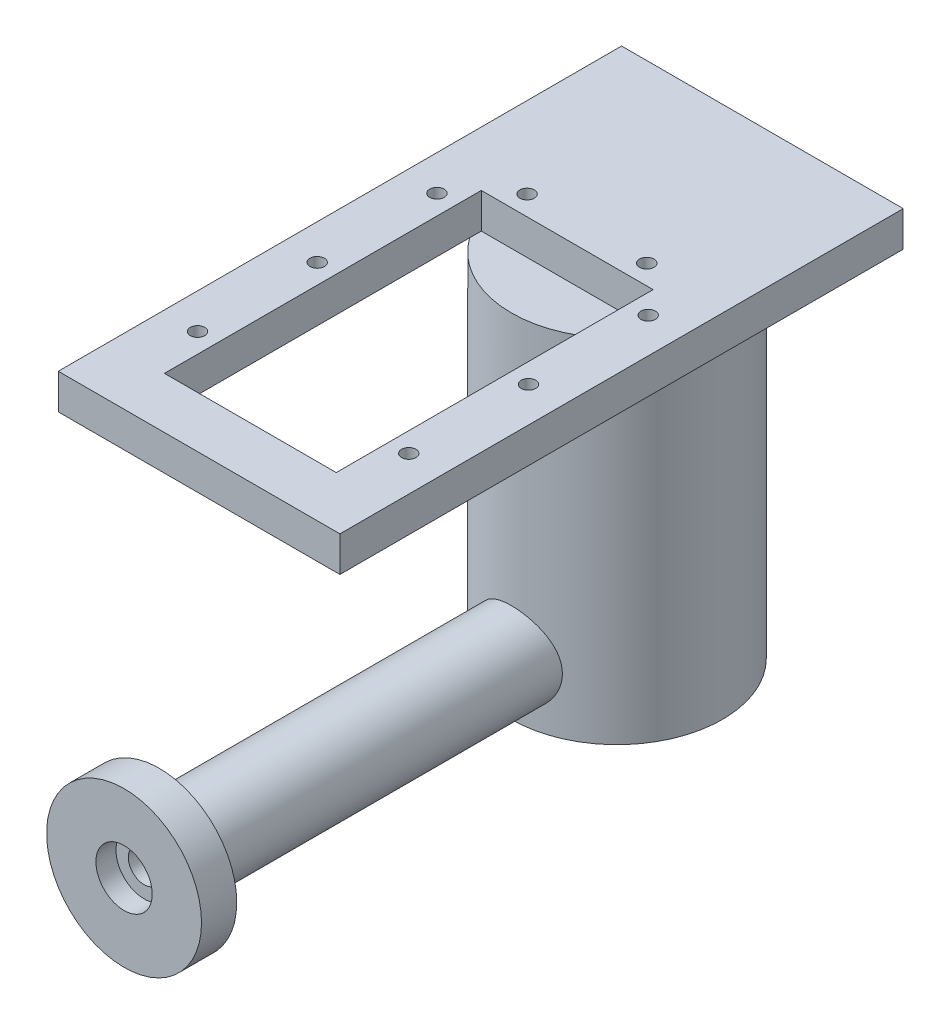
ISO-10303-21;
HEADER;
FILE_DESCRIPTION(('STEP AP214'),'2;1');
FILE_NAME('part.step','',(''),(''),'','','');
FILE_SCHEMA(('AUTOMOTIVE_DESIGN { 1 0 10303 214 1 1 1 1 }'));
ENDSEC;
DATA;
#1=APPLICATION_CONTEXT('core data for automotive mechanical design processes');
#2=APPLICATION_PROTOCOL_DEFINITION('international standard','automotive_design',2000,#1);
#3=PRODUCT_CONTEXT('',#1,'mechanical');
#4=PRODUCT('Part','Part','',(#3));
#5=PRODUCT_RELATED_PRODUCT_CATEGORY('part','',(#4));
#6=PRODUCT_DEFINITION_FORMATION('','',#4);
#7=PRODUCT_DEFINITION_CONTEXT('part definition',#1,'design');
#8=PRODUCT_DEFINITION('design','',#6,#7);
#9=PRODUCT_DEFINITION_SHAPE('','',#8);
#10=(LENGTH_UNIT() NAMED_UNIT(*) SI_UNIT(.MILLI.,.METRE.));
#11=(NAMED_UNIT(*) PLANE_ANGLE_UNIT() SI_UNIT($,.RADIAN.));
#12=(NAMED_UNIT(*) SI_UNIT($,.STERADIAN.) SOLID_ANGLE_UNIT());
#13=UNCERTAINTY_MEASURE_WITH_UNIT(LENGTH_MEASURE(1.E-05),#10,'distance_accuracy_value','');
#14=(GEOMETRIC_REPRESENTATION_CONTEXT(3) GLOBAL_UNCERTAINTY_ASSIGNED_CONTEXT((#13)) GLOBAL_UNIT_ASSIGNED_CONTEXT((#10,
#11,#12)) REPRESENTATION_CONTEXT('',''));
#15=CARTESIAN_POINT('',(0.,0.,0.));
#16=DIRECTION('',(0.,0.,1.));
#17=DIRECTION('',(1.,0.,0.));
#18=AXIS2_PLACEMENT_3D('',#15,#16,#17);
#19=CARTESIAN_POINT('',(0.,8.,65.));
#20=DIRECTION('',(0.,0.,-1.));
#21=DIRECTION('',(-1.,0.,0.));
#22=AXIS2_PLACEMENT_3D('',#19,#20,#21);
#23=CYLINDRICAL_SURFACE('',#22,6.);
#24=CARTESIAN_POINT('',(0.,8.,65.));
#25=DIRECTION('',(0.,0.,1.));
#26=DIRECTION('',(1.,0.,0.));
#27=AXIS2_PLACEMENT_3D('',#24,#25,#26);
#28=CIRCLE('',#27,6.);
#29=CARTESIAN_POINT('',(6.,8.,65.));
#30=VERTEX_POINT('',#29);
#31=EDGE_CURVE('E11',#30,#30,#28,.T.);
#32=ORIENTED_EDGE('',*,*,#31,.F.);
#33=EDGE_LOOP('',(#32));
#34=FACE_BOUND('',#33,.T.);
#35=CARTESIAN_POINT('',(6.,8.,13.7477270848675));
#36=CARTESIAN_POINT('',(5.99999875640954,8.16076598482738,13.7477283260629));
#37=CARTESIAN_POINT('',(5.99352975206176,8.32158110601548,13.7505565594333));
#38=CARTESIAN_POINT('',(5.96771672897827,8.64204882535129,13.7617785399654));
#39=CARTESIAN_POINT('',(5.94836482999676,8.80170065146873,13.7701756935283));
#40=CARTESIAN_POINT('',(5.89694174030869,9.11890142617686,13.7922754357519));
#41=CARTESIAN_POINT('',(5.86484520413903,9.27644553381237,13.8059885951419));
#42=CARTESIAN_POINT('',(5.78825391878448,9.58804060527395,13.8382744776157));
#43=CARTESIAN_POINT('',(5.74375401859824,9.74209008901072,13.8568492194736));
#44=CARTESIAN_POINT('',(5.64299599700453,10.0449832651282,13.8981849934125));
#45=CARTESIAN_POINT('',(5.58678827846126,10.1938461795796,13.9209280318917));
#46=CARTESIAN_POINT('',(5.46298123967255,10.4861745059142,13.969977180975));
#47=CARTESIAN_POINT('',(5.39537758446074,10.6296378383192,13.9962846467221));
#48=CARTESIAN_POINT('',(5.17633416323045,11.0504811630918,14.0794173286744));
#49=CARTESIAN_POINT('',(5.00853494267613,11.3186931077142,14.1405074748907));
#50=CARTESIAN_POINT('',(4.62391158998239,11.8378592545825,14.2710405221571));
#51=CARTESIAN_POINT('',(4.40499626343136,12.0871970513873,14.340752300891));
#52=CARTESIAN_POINT('',(4.0481020989243,12.4317390645763,14.4439708651047));
#53=CARTESIAN_POINT('',(3.9242905158216,12.5417399755175,14.4781748598032));
#54=CARTESIAN_POINT('',(3.66779743847793,12.7512789373329,14.5452673983772));
#55=CARTESIAN_POINT('',(3.53511902618019,12.850820593021,14.5781563930343));
#56=CARTESIAN_POINT('',(3.25615691069843,13.042541605752,14.6430448615306));
#57=CARTESIAN_POINT('',(3.10954147620186,13.1342681993675,14.6749563607157));
#58=CARTESIAN_POINT('',(2.80847871906791,13.3049385222444,14.7355355933009));
#59=CARTESIAN_POINT('',(2.65403441109174,13.3838871235516,14.7642045617649));
#60=CARTESIAN_POINT('',(2.33831705380736,13.5283274480482,14.8174861755334));
#61=CARTESIAN_POINT('',(2.1770447537532,13.5938206431435,14.8420992644581));
#62=CARTESIAN_POINT('',(1.8488303602226,13.710706307039,14.8865456688032));
#63=CARTESIAN_POINT('',(1.68188862975968,13.762099676745,14.9063792895972));
#64=CARTESIAN_POINT('',(1.35182764993867,13.8480957076311,14.9398371015626));
#65=CARTESIAN_POINT('',(1.18891435676812,13.8833905448022,14.9537153305611));
#66=CARTESIAN_POINT('',(0.860364736698413,13.940333707631,14.9762104160573));
#67=CARTESIAN_POINT('',(0.694728571347245,13.9619828399113,14.9848275835451));
#68=CARTESIAN_POINT('',(0.362083680846929,13.9913910715253,14.9965524359366));
#69=CARTESIAN_POINT('',(0.195075387211748,13.9991543815219,14.9996617909972));
#70=CARTESIAN_POINT('',(-0.139014166426377,14.0007146652515,15.0002858279534));
#71=CARTESIAN_POINT('',(-0.30609542365763,13.9945121299872,14.9978007065363));
#72=CARTESIAN_POINT('',(-0.629581360842823,13.9689571486784,14.9876056811723));
#73=CARTESIAN_POINT('',(-0.786056489987584,13.950366478925,14.9801985155737));
#74=CARTESIAN_POINT('',(-1.09682374164985,13.9009947102182,14.9606558816458));
#75=CARTESIAN_POINT('',(-1.25111513504043,13.8702096346988,14.9485188709466));
#76=CARTESIAN_POINT('',(-1.55636446880933,13.7967547638698,14.9198265516691));
#77=CARTESIAN_POINT('',(-1.70732347781249,13.7540888400518,14.9032726824411));
#78=CARTESIAN_POINT('',(-2.00504692560526,13.6572347463826,14.8661462906548));
#79=CARTESIAN_POINT('',(-2.15180974700395,13.6030421998243,14.8455722418593));
#80=CARTESIAN_POINT('',(-2.44232275401438,13.4827122452092,14.8005733913406));
#81=CARTESIAN_POINT('',(-2.58599723661979,13.4164113777625,14.7760965609745));
#82=CARTESIAN_POINT('',(-2.86725918170996,13.2729288476492,14.7241067343258));
#83=CARTESIAN_POINT('',(-3.00484439132129,13.1957432013856,14.696592627269));
#84=CARTESIAN_POINT('',(-3.40726603321778,12.948688374456,14.6104618941818));
#85=CARTESIAN_POINT('',(-3.66195901653258,12.7632418772394,14.5482260457696));
#86=CARTESIAN_POINT('',(-4.15437949370372,12.3419915764659,14.4156330049764));
#87=CARTESIAN_POINT('',(-4.38989525780835,12.1036809528053,14.3450108782861));
#88=CARTESIAN_POINT('',(-4.71121812404964,11.7191971043517,14.2413889925105));
#89=CARTESIAN_POINT('',(-4.81305918105095,11.5864329939912,14.2072110490304));
#90=CARTESIAN_POINT('',(-5.0054684951315,11.3125897118592,14.1405668936191));
#91=CARTESIAN_POINT('',(-5.09604089492643,11.171513624108,14.1081000551767));
#92=CARTESIAN_POINT('',(-5.2677144885335,10.8776679791937,14.0449207716186));
#93=CARTESIAN_POINT('',(-5.34846830074845,10.7246787891823,14.0142856556237));
#94=CARTESIAN_POINT('',(-5.49666677344656,10.4117640686962,13.9568252487564));
#95=CARTESIAN_POINT('',(-5.56411683616808,10.2518413860096,13.9299984127055));
#96=CARTESIAN_POINT('',(-5.68507549818268,9.92615715736025,13.8810726170423));
#97=CARTESIAN_POINT('',(-5.73858849912392,9.76039747367877,13.8589721651234));
#98=CARTESIAN_POINT('',(-5.83111405710325,9.42425050711976,13.8202977451039));
#99=CARTESIAN_POINT('',(-5.87012778144672,9.2538635979558,13.803723332125));
#100=CARTESIAN_POINT('',(-5.93126188446898,8.92037550293277,13.7775602957139));
#101=CARTESIAN_POINT('',(-5.95426866502425,8.75746509869363,13.7676067715781));
#102=CARTESIAN_POINT('',(-5.98682783069773,8.4300594191083,13.7534799529363));
#103=CARTESIAN_POINT('',(-5.99638101339171,8.26556423829532,13.7493063157788));
#104=CARTESIAN_POINT('',(-6.00192022727181,7.93634499724553,13.7468891908443));
#105=CARTESIAN_POINT('',(-5.99790972463034,7.77162100623468,13.7486441880165));
#106=CARTESIAN_POINT('',(-5.97637695694085,7.44323030234847,13.7580178863429));
#107=CARTESIAN_POINT('',(-5.95885503253298,7.27956356292335,13.7656364396694));
#108=CARTESIAN_POINT('',(-5.91189113707813,6.96388493285905,13.7858678469555));
#109=CARTESIAN_POINT('',(-5.88318889041452,6.81174216524755,13.7981698606254));
#110=CARTESIAN_POINT('',(-5.81422990546568,6.51049878730527,13.8273689308218));
#111=CARTESIAN_POINT('',(-5.77396942701893,6.36139917847391,13.8442674746596));
#112=CARTESIAN_POINT('',(-5.68227161206331,6.0672507608385,13.8821556875076));
#113=CARTESIAN_POINT('',(-5.63083646021821,5.92220116649752,13.9031445567712));
#114=CARTESIAN_POINT('',(-5.51718647350251,5.63689974950036,13.9486342853423));
#115=CARTESIAN_POINT('',(-5.45496750289055,5.49664979237216,13.9731364914375));
#116=CARTESIAN_POINT('',(-5.31751145640008,5.21622103433919,14.0260368054118));
#117=CARTESIAN_POINT('',(-5.24185178482307,5.07627148339986,14.054551887834));
#118=CARTESIAN_POINT('',(-5.07988717682862,4.80313174732677,14.1139004091642));
#119=CARTESIAN_POINT('',(-4.99357859530799,4.66994389885387,14.144734640495));
#120=CARTESIAN_POINT('',(-4.81086355761932,4.41103058661941,14.2079180408565));
#121=CARTESIAN_POINT('',(-4.71445526541627,4.28530648622995,14.2402674847459));
#122=CARTESIAN_POINT('',(-4.51210358125893,4.04197483985672,14.3056711379351));
#123=CARTESIAN_POINT('',(-4.40615981558121,3.92436761231666,14.338725374819));
#124=CARTESIAN_POINT('',(-4.17710486838273,3.68947089789745,14.4071898083664));
#125=CARTESIAN_POINT('',(-4.05330323673504,3.57285146369598,14.442592979753));
#126=CARTESIAN_POINT('',(-3.79611595891185,3.35044107746035,14.5123136561683));
#127=CARTESIAN_POINT('',(-3.66273336488668,3.24464670276108,14.5466315019691));
#128=CARTESIAN_POINT('',(-3.38706145939603,3.04451435610423,14.6132792135403));
#129=CARTESIAN_POINT('',(-3.24476806677012,2.95018169264924,14.6456081547515));
#130=CARTESIAN_POINT('',(-2.95225256674959,2.77378136334621,14.7073633349577));
#131=CARTESIAN_POINT('',(-2.80203390506011,2.69170842578634,14.7367908197248));
#132=CARTESIAN_POINT('',(-2.49453307495679,2.54045157600446,14.7919473555791));
#133=CARTESIAN_POINT('',(-2.3372490996887,2.47127098437562,14.8176754534518));
#134=CARTESIAN_POINT('',(-2.01680521759424,2.34650155372973,14.8646797598965));
#135=CARTESIAN_POINT('',(-1.85364780662784,2.29090701787589,14.8859578338886));
#136=CARTESIAN_POINT('',(-1.52264805192433,2.19385845199868,14.9234471639802));
#137=CARTESIAN_POINT('',(-1.35480680859647,2.15240113036746,14.9396595994531));
#138=CARTESIAN_POINT('',(-1.01574606559106,2.08407562736268,14.9665350610502));
#139=CARTESIAN_POINT('',(-0.844526795116487,2.05720645967028,14.9771984623478));
#140=CARTESIAN_POINT('',(-0.511396994408887,2.01963967541453,14.9921458117432));
#141=CARTESIAN_POINT('',(-0.349608608417646,2.00800071584866,14.9968008342727));
#142=CARTESIAN_POINT('',(-0.0255568035504901,1.99786526314398,15.0008532559057));
#143=CARTESIAN_POINT('',(0.13670659774313,1.99936828956347,15.0002508472092));
#144=CARTESIAN_POINT('',(0.460449157871509,2.01549904517884,14.9938053140504));
#145=CARTESIAN_POINT('',(0.621928426150297,2.03012488656084,14.9879629433954));
#146=CARTESIAN_POINT('',(0.942913616351041,2.07234304237388,14.9711970812456));
#147=CARTESIAN_POINT('',(1.10241954563224,2.09993530843377,14.9602736087057));
#148=CARTESIAN_POINT('',(1.41340092731344,2.16675006249559,14.9340514560138));
#149=CARTESIAN_POINT('',(1.56497209153591,2.20558587323356,14.9188987624389));
#150=CARTESIAN_POINT('',(1.86423948532529,2.29482683138478,14.8844652752771));
#151=CARTESIAN_POINT('',(2.01193442094207,2.34523578871987,14.8651831223981));
#152=CARTESIAN_POINT('',(2.302462712288,2.45717619515102,14.8229622791787));
#153=CARTESIAN_POINT('',(2.44529715629449,2.51870513472082,14.8000244139869));
#154=CARTESIAN_POINT('',(2.72537941223682,2.65243971671062,14.7510179336099));
#155=CARTESIAN_POINT('',(2.86262507421093,2.72464941936831,14.7249481285447));
#156=CARTESIAN_POINT('',(3.13662388518831,2.88260994638361,14.6690826919464));
#157=CARTESIAN_POINT('',(3.27309180108705,2.96881555131694,14.6391738407242));
#158=CARTESIAN_POINT('',(3.53838180351729,3.15171951689201,14.5773253906917));
#159=CARTESIAN_POINT('',(3.66720122604104,3.24842150069047,14.5453850922484));
#160=CARTESIAN_POINT('',(3.91649343612947,3.4517088619109,14.480251425724));
#161=CARTESIAN_POINT('',(4.03696455988819,3.55829619963079,14.447057809883));
#162=CARTESIAN_POINT('',(4.26890539529756,3.78072670262355,14.3802300314779));
#163=CARTESIAN_POINT('',(4.38037483126384,3.89657015115672,14.3465958554578));
#164=CARTESIAN_POINT('',(4.6003520349242,4.14436931770692,14.2776350231095));
#165=CARTESIAN_POINT('',(4.70824454883581,4.27687901691599,14.2423331872708));
#166=CARTESIAN_POINT('',(4.91246454048886,4.55081614977952,14.1731899755842));
#167=CARTESIAN_POINT('',(5.0087959135827,4.69224055512317,14.1393481102969));
#168=CARTESIAN_POINT('',(5.18930521843518,4.98330426589871,14.0741014017048));
#169=CARTESIAN_POINT('',(5.27347593316246,5.13294837739946,14.0426980106418));
#170=CARTESIAN_POINT('',(5.42888140715686,5.43938662075409,13.9833532160291));
#171=CARTESIAN_POINT('',(5.50012246229139,5.59617722596415,13.9554101296628));
#172=CARTESIAN_POINT('',(5.62329338728312,5.90161698772481,13.9062060888812));
#173=CARTESIAN_POINT('',(5.67638059374281,6.0497399517391,13.8845710059473));
#174=CARTESIAN_POINT('',(5.77085722264898,6.3501563851321,13.8455704717994));
#175=CARTESIAN_POINT('',(5.81225194839873,6.5024479292954,13.8282030853728));
#176=CARTESIAN_POINT('',(5.88290316620707,6.80992357107783,13.7982941020336));
#177=CARTESIAN_POINT('',(5.91218652902551,6.9651004584769,13.7857418266595));
#178=CARTESIAN_POINT('',(5.95843701087142,7.27754448449443,13.7658152395796));
#179=CARTESIAN_POINT('',(5.97541127868373,7.43481035575322,13.7584379224814));
#180=CARTESIAN_POINT('',(5.99076318011059,7.66032523302881,13.751755327731));
#181=CARTESIAN_POINT('',(5.99422579943118,7.72819955445766,13.7502459479373));
#182=CARTESIAN_POINT('',(5.99884455686221,7.86404631736154,13.7482315272618));
#183=CARTESIAN_POINT('',(6.00000052586257,7.9320187656651,13.7477265600177));
#184=CARTESIAN_POINT('',(6.,8.,13.7477270848675));
#185=B_SPLINE_CURVE_WITH_KNOTS('',3,(#35,#36,#37,#38,#39,#40,#41,#42,#43,#44,#45,#46,#47,#48,
#49,#50,#51,#52,#53,#54,#55,#56,#57,#58,#59,#60,#61,#62,#63,#64,#65,#66,#67,#68,#69,#70,#71,#72,
#73,#74,#75,#76,#77,#78,#79,#80,#81,#82,#83,#84,#85,#86,#87,#88,#89,#90,#91,#92,#93,#94,#95,#96,
#97,#98,#99,#100,#101,#102,#103,#104,#105,#106,#107,#108,#109,#110,#111,#112,#113,#114,#115,
#116,#117,#118,#119,#120,#121,#122,#123,#124,#125,#126,#127,#128,#129,#130,#131,#132,#133,#134,
#135,#136,#137,#138,#139,#140,#141,#142,#143,#144,#145,#146,#147,#148,#149,#150,#151,#152,#153,
#154,#155,#156,#157,#158,#159,#160,#161,#162,#163,#164,#165,#166,#167,#168,#169,#170,#171,#172,
#173,#174,#175,#176,#177,#178,#179,#180,#181,#182,#183,#184),.UNSPECIFIED.,.T.,.F.,(4,2,2,2,2,2,
2,2,2,2,2,2,2,2,2,2,2,2,2,2,2,2,2,2,2,2,2,2,2,2,2,2,2,2,2,2,2,2,2,2,2,2,2,2,2,2,2,2,2,2,2,2,2,2,
2,2,2,2,2,2,2,2,2,2,2,2,2,2,2,2,2,2,2,2,4),(0.,0.482229125007606,0.964753492666786,
1.44824230932755,1.93193221431692,2.41358131868909,2.89541405552194,3.85788445035762,
4.87027013417452,5.37714851669966,5.88385162504574,6.41078994114098,6.93752686828076,
7.4642061442031,7.99085176020979,8.4920122856123,8.99314318371741,9.49412209577398,
9.99508339499091,10.4677763229104,10.9406235219094,11.4133168189293,11.8861899210207,
12.3659950936627,12.8459763227003,13.8053197638543,14.827648638094,15.3395121452938,
15.8511869156833,16.3775800271824,16.9037589447638,17.429771480738,17.9557416594036,
18.4495809207953,18.9433909044569,19.4370747055101,19.9307460605728,20.3961592499499,
20.8617232138062,21.3271962410503,21.7928481801528,22.2772086524077,22.7617353827804,
23.2463503490362,23.7309843170643,24.2515501140932,24.7719508068031,25.2925916122044,
25.8130078923152,26.3335580277819,26.8538895128004,27.3740997647064,27.8942748403263,
28.3804860466243,28.8666794781986,29.3528029784681,29.8389246652723,30.309990273523,
30.7812111812125,31.2523258775871,31.7236201282936,32.2155707501999,32.7076917276986,
33.1999105039097,33.6921443490278,34.2149887213889,34.7376564316676,35.2606330684224,
35.7833543637692,36.2593204433439,36.7350702933027,37.2097588887462,37.684171576794,
37.8880712265046,38.0919858243933),.UNSPECIFIED.);
#186=CARTESIAN_POINT('',(6.,8.,13.7477270848675));
#187=VERTEX_POINT('',#186);
#188=EDGE_CURVE('E53',#187,#187,#185,.T.);
#189=ORIENTED_EDGE('',*,*,#188,.T.);
#190=EDGE_LOOP('',(#189));
#191=FACE_BOUND('',#190,.T.);
#192=ADVANCED_FACE('F47',(#34,#191),#23,.T.);
#193=CARTESIAN_POINT('',(0.,50.,0.));
#194=DIRECTION('',(0.,-1.,0.));
#195=DIRECTION('',(0.,0.,-1.));
#196=AXIS2_PLACEMENT_3D('',#193,#194,#195);
#197=CYLINDRICAL_SURFACE('',#196,15.);
#198=ORIENTED_EDGE('',*,*,#188,.F.);
#199=EDGE_LOOP('',(#198));
#200=FACE_BOUND('',#199,.T.);
#201=ADVANCED_FACE('F69',(#200),#197,.F.);
#202=CARTESIAN_POINT('',(0.,8.,70.));
#203=DIRECTION('',(0.,0.,-1.));
#204=DIRECTION('',(-1.,0.,0.));
#205=AXIS2_PLACEMENT_3D('',#202,#203,#204);
#206=CYLINDRICAL_SURFACE('',#205,11.);
#207=CARTESIAN_POINT('',(0.,8.,70.));
#208=DIRECTION('',(0.,0.,1.));
#209=DIRECTION('',(1.,0.,0.));
#210=AXIS2_PLACEMENT_3D('',#207,#208,#209);
#211=CIRCLE('',#210,11.);
#212=CARTESIAN_POINT('',(11.,8.,70.));
#213=VERTEX_POINT('',#212);
#214=EDGE_CURVE('E57',#213,#213,#211,.T.);
#215=ORIENTED_EDGE('',*,*,#214,.F.);
#216=EDGE_LOOP('',(#215));
#217=FACE_BOUND('',#216,.T.);
#218=CARTESIAN_POINT('',(0.,8.,65.));
#219=DIRECTION('',(0.,0.,1.));
#220=DIRECTION('',(1.,0.,0.));
#221=AXIS2_PLACEMENT_3D('',#218,#219,#220);
#222=CIRCLE('',#221,11.);
#223=CARTESIAN_POINT('',(11.,8.,65.));
#224=VERTEX_POINT('',#223);
#225=EDGE_CURVE('E61',#224,#224,#222,.T.);
#226=ORIENTED_EDGE('',*,*,#225,.T.);
#227=EDGE_LOOP('',(#226));
#228=FACE_BOUND('',#227,.T.);
#229=ADVANCED_FACE('F73',(#217,#228),#206,.T.);
#230=CARTESIAN_POINT('',(0.,8.,70.));
#231=DIRECTION('',(0.,0.,1.));
#232=DIRECTION('',(1.,0.,0.));
#233=AXIS2_PLACEMENT_3D('',#230,#231,#232);
#234=PLANE('',#233);
#235=CARTESIAN_POINT('',(0.,8.,70.));
#236=DIRECTION('',(0.,0.,1.));
#237=DIRECTION('',(1.,0.,0.));
#238=AXIS2_PLACEMENT_3D('',#235,#236,#237);
#239=CIRCLE('',#238,4.);
#240=CARTESIAN_POINT('',(4.,8.,70.));
#241=VERTEX_POINT('',#240);
#242=EDGE_CURVE('E162',#241,#241,#239,.T.);
#243=ORIENTED_EDGE('',*,*,#242,.F.);
#244=EDGE_LOOP('',(#243));
#245=FACE_BOUND('',#244,.T.);
#246=ORIENTED_EDGE('',*,*,#214,.T.);
#247=EDGE_LOOP('',(#246));
#248=FACE_BOUND('',#247,.T.);
#249=ADVANCED_FACE('F77',(#245,#248),#234,.T.);
#250=CARTESIAN_POINT('',(0.,8.,65.));
#251=DIRECTION('',(0.,0.,1.));
#252=DIRECTION('',(1.,0.,0.));
#253=AXIS2_PLACEMENT_3D('',#250,#251,#252);
#254=PLANE('',#253);
#255=ORIENTED_EDGE('',*,*,#31,.T.);
#256=EDGE_LOOP('',(#255));
#257=FACE_BOUND('',#256,.T.);
#258=ORIENTED_EDGE('',*,*,#225,.F.);
#259=EDGE_LOOP('',(#258));
#260=FACE_BOUND('',#259,.T.);
#261=ADVANCED_FACE('F79',(#257,#260),#254,.F.);
#262=CARTESIAN_POINT('',(0.,8.,67.15));
#263=DIRECTION('',(0.,0.,1.));
#264=DIRECTION('',(1.,0.,0.));
#265=AXIS2_PLACEMENT_3D('',#262,#263,#264);
#266=CYLINDRICAL_SURFACE('',#265,4.);
#267=CARTESIAN_POINT('',(0.,8.,67.15));
#268=DIRECTION('',(0.,0.,1.));
#269=DIRECTION('',(1.,0.,0.));
#270=AXIS2_PLACEMENT_3D('',#267,#268,#269);
#271=CIRCLE('',#270,4.);
#272=CARTESIAN_POINT('',(4.,8.,67.15));
#273=VERTEX_POINT('',#272);
#274=EDGE_CURVE('E166',#273,#273,#271,.T.);
#275=ORIENTED_EDGE('',*,*,#274,.F.);
#276=EDGE_LOOP('',(#275));
#277=FACE_BOUND('',#276,.T.);
#278=ORIENTED_EDGE('',*,*,#242,.T.);
#279=EDGE_LOOP('',(#278));
#280=FACE_BOUND('',#279,.T.);
#281=ADVANCED_FACE('F82',(#277,#280),#266,.F.);
#282=CARTESIAN_POINT('',(0.,8.,67.15));
#283=DIRECTION('',(0.,0.,1.));
#284=DIRECTION('',(1.,0.,0.));
#285=AXIS2_PLACEMENT_3D('',#282,#283,#284);
#286=PLANE('',#285);
#287=CARTESIAN_POINT('',(0.,8.,67.15));
#288=DIRECTION('',(0.,0.,1.));
#289=DIRECTION('',(1.,0.,0.));
#290=AXIS2_PLACEMENT_3D('',#287,#288,#289);
#291=CIRCLE('',#290,2.25);
#292=CARTESIAN_POINT('',(2.25,8.,67.15));
#293=VERTEX_POINT('',#292);
#294=EDGE_CURVE('E163',#293,#293,#291,.T.);
#295=ORIENTED_EDGE('',*,*,#294,.F.);
#296=EDGE_LOOP('',(#295));
#297=FACE_BOUND('',#296,.T.);
#298=ORIENTED_EDGE('',*,*,#274,.T.);
#299=EDGE_LOOP('',(#298));
#300=FACE_BOUND('',#299,.T.);
#301=ADVANCED_FACE('F88',(#297,#300),#286,.T.);
#302=CARTESIAN_POINT('',(0.,8.,64.65));
#303=DIRECTION('',(0.,0.,1.));
#304=DIRECTION('',(1.,0.,0.));
#305=AXIS2_PLACEMENT_3D('',#302,#303,#304);
#306=CYLINDRICAL_SURFACE('',#305,2.25);
#307=CARTESIAN_POINT('',(0.,8.,64.65));
#308=DIRECTION('',(0.,0.,1.));
#309=DIRECTION('',(1.,0.,0.));
#310=AXIS2_PLACEMENT_3D('',#307,#308,#309);
#311=CIRCLE('',#310,2.25);
#312=CARTESIAN_POINT('',(2.25,8.,64.65));
#313=VERTEX_POINT('',#312);
#314=EDGE_CURVE('E161',#313,#313,#311,.T.);
#315=ORIENTED_EDGE('',*,*,#314,.F.);
#316=EDGE_LOOP('',(#315));
#317=FACE_BOUND('',#316,.T.);
#318=ORIENTED_EDGE('',*,*,#294,.T.);
#319=EDGE_LOOP('',(#318));
#320=FACE_BOUND('',#319,.T.);
#321=ADVANCED_FACE('F92',(#317,#320),#306,.F.);
#322=CARTESIAN_POINT('',(0.,8.,64.65));
#323=DIRECTION('',(0.,0.,1.));
#324=DIRECTION('',(1.,0.,0.));
#325=AXIS2_PLACEMENT_3D('',#322,#323,#324);
#326=PLANE('',#325);
#327=ORIENTED_EDGE('',*,*,#314,.T.);
#328=EDGE_LOOP('',(#327));
#329=FACE_BOUND('',#328,.T.);
#330=ADVANCED_FACE('F96',(#329),#326,.T.);
#331=CLOSED_SHELL('',(#192,#201,#229,#249,#261,#281,#301,#321,#330));
#332=MANIFOLD_SOLID_BREP('B2',#331);
#333=CARTESIAN_POINT('',(0.,50.,0.));
#334=DIRECTION('',(0.,1.,0.));
#335=DIRECTION('',(0.,0.,1.));
#336=AXIS2_PLACEMENT_3D('',#333,#334,#335);
#337=PLANE('',#336);
#338=DIRECTION('',(-1.,0.,0.));
#339=VECTOR('',#338,1.);
#340=CARTESIAN_POINT('',(-12.2,50.,7.06804977885682));
#341=LINE('',#340,#339);
#342=CARTESIAN_POINT('',(12.2,50.,7.06804977885682));
#343=VERTEX_POINT('',#342);
#344=CARTESIAN_POINT('',(-12.2,50.,7.06804977885682));
#345=VERTEX_POINT('',#344);
#346=EDGE_CURVE('E204',#343,#345,#341,.T.);
#347=ORIENTED_EDGE('',*,*,#346,.T.);
#348=DIRECTION('',(0.,0.,1.));
#349=VECTOR('',#348,1.);
#350=CARTESIAN_POINT('',(-12.2,50.,52.0680497788568));
#351=LINE('',#350,#349);
#352=CARTESIAN_POINT('',(-12.2,50.,8.72696969170859));
#353=VERTEX_POINT('',#352);
#354=EDGE_CURVE('E291',#345,#353,#351,.T.);
#355=ORIENTED_EDGE('',*,*,#354,.T.);
#356=CARTESIAN_POINT('',(0.,50.,0.));
#357=DIRECTION('',(0.,1.,0.));
#358=DIRECTION('',(0.,0.,1.));
#359=AXIS2_PLACEMENT_3D('',#356,#357,#358);
#360=CIRCLE('',#359,15.);
#361=CARTESIAN_POINT('',(12.2,50.,8.72696969170859));
#362=VERTEX_POINT('',#361);
#363=EDGE_CURVE('E329',#353,#362,#360,.T.);
#364=ORIENTED_EDGE('',*,*,#363,.T.);
#365=DIRECTION('',(0.,0.,-1.));
#366=VECTOR('',#365,1.);
#367=CARTESIAN_POINT('',(12.2,50.,52.0680497788568));
#368=LINE('',#367,#366);
#369=EDGE_CURVE('E45',#362,#343,#368,.T.);
#370=ORIENTED_EDGE('',*,*,#369,.T.);
#371=EDGE_LOOP('',(#347,#355,#364,#370));
#372=FACE_BOUND('',#371,.T.);
#373=ADVANCED_FACE('F186',(#372),#337,.T.);
#374=CARTESIAN_POINT('',(0.,50.,0.));
#375=DIRECTION('',(0.,-1.,0.));
#376=DIRECTION('',(0.,0.,-1.));
#377=AXIS2_PLACEMENT_3D('',#374,#375,#376);
#378=CYLINDRICAL_SURFACE('',#377,15.);
#379=EDGE_CURVE('E195',#362,#353,#360,.T.);
#380=ORIENTED_EDGE('',*,*,#379,.F.);
#381=ORIENTED_EDGE('',*,*,#363,.F.);
#382=EDGE_LOOP('',(#380,#381));
#383=FACE_BOUND('',#382,.T.);
#384=CARTESIAN_POINT('',(0.,0.,0.));
#385=DIRECTION('',(0.,1.,0.));
#386=DIRECTION('',(0.,0.,1.));
#387=AXIS2_PLACEMENT_3D('',#384,#385,#386);
#388=CIRCLE('',#387,15.);
#389=CARTESIAN_POINT('',(0.,0.,15.));
#390=VERTEX_POINT('',#389);
#391=EDGE_CURVE('E190',#390,#390,#388,.T.);
#392=ORIENTED_EDGE('',*,*,#391,.T.);
#393=EDGE_LOOP('',(#392));
#394=FACE_BOUND('',#393,.T.);
#395=ADVANCED_FACE('F188',(#383,#394),#378,.T.);
#396=CARTESIAN_POINT('',(0.,0.,0.));
#397=DIRECTION('',(0.,1.,0.));
#398=DIRECTION('',(0.,0.,1.));
#399=AXIS2_PLACEMENT_3D('',#396,#397,#398);
#400=PLANE('',#399);
#401=ORIENTED_EDGE('',*,*,#391,.F.);
#402=EDGE_LOOP('',(#401));
#403=FACE_BOUND('',#402,.T.);
#404=ADVANCED_FACE('F339',(#403),#400,.F.);
#405=CARTESIAN_POINT('',(0.,55.,0.));
#406=DIRECTION('',(0.,-1.,0.));
#407=DIRECTION('',(0.,0.,-1.));
#408=AXIS2_PLACEMENT_3D('',#405,#406,#407);
#409=PLANE('',#408);
#410=CARTESIAN_POINT('',(-15.0000000001374,55.,44.5680497778319));
#411=DIRECTION('',(0.,1.,0.));
#412=DIRECTION('',(0.,0.,1.));
#413=AXIS2_PLACEMENT_3D('',#410,#411,#412);
#414=CIRCLE('',#413,1.0249999998364);
#415=CARTESIAN_POINT('',(-15.0000000001374,55.,45.5930497776683));
#416=VERTEX_POINT('',#415);
#417=EDGE_CURVE('E470',#416,#416,#414,.T.);
#418=ORIENTED_EDGE('',*,*,#417,.F.);
#419=EDGE_LOOP('',(#418));
#420=FACE_BOUND('',#419,.T.);
#421=CARTESIAN_POINT('',(-15.0000000001377,55.,27.5680497778319));
#422=DIRECTION('',(0.,1.,0.));
#423=DIRECTION('',(0.,0.,1.));
#424=AXIS2_PLACEMENT_3D('',#421,#422,#423);
#425=CIRCLE('',#424,1.02499999983636);
#426=CARTESIAN_POINT('',(-15.0000000001377,55.,28.5930497776682));
#427=VERTEX_POINT('',#426);
#428=EDGE_CURVE('E464',#427,#427,#425,.T.);
#429=ORIENTED_EDGE('',*,*,#428,.F.);
#430=EDGE_LOOP('',(#429));
#431=FACE_BOUND('',#430,.T.);
#432=CARTESIAN_POINT('',(-15.000000000138,55.,10.5680497778319));
#433=DIRECTION('',(0.,1.,0.));
#434=DIRECTION('',(0.,0.,1.));
#435=AXIS2_PLACEMENT_3D('',#432,#433,#434);
#436=CIRCLE('',#435,1.02499999983631);
#437=CARTESIAN_POINT('',(-15.000000000138,55.,11.5930497776682));
#438=VERTEX_POINT('',#437);
#439=EDGE_CURVE('E458',#438,#438,#436,.T.);
#440=ORIENTED_EDGE('',*,*,#439,.F.);
#441=EDGE_LOOP('',(#440));
#442=FACE_BOUND('',#441,.T.);
#443=CARTESIAN_POINT('',(-8.50000000013805,55.,4.26804977783178));
#444=DIRECTION('',(0.,1.,0.));
#445=DIRECTION('',(0.,0.,1.));
#446=AXIS2_PLACEMENT_3D('',#443,#444,#445);
#447=CIRCLE('',#446,1.0249999998363);
#448=CARTESIAN_POINT('',(-8.50000000013805,55.,5.29304977766808));
#449=VERTEX_POINT('',#448);
#450=EDGE_CURVE('E452',#449,#449,#447,.T.);
#451=ORIENTED_EDGE('',*,*,#450,.F.);
#452=EDGE_LOOP('',(#451));
#453=FACE_BOUND('',#452,.T.);
#454=CARTESIAN_POINT('',(8.49999999986195,55.,4.26804977783152));
#455=DIRECTION('',(0.,1.,0.));
#456=DIRECTION('',(0.,0.,1.));
#457=AXIS2_PLACEMENT_3D('',#454,#455,#456);
#458=CIRCLE('',#457,1.02499999983631);
#459=CARTESIAN_POINT('',(8.49999999986195,55.,5.29304977766783));
#460=VERTEX_POINT('',#459);
#461=EDGE_CURVE('E446',#460,#460,#458,.T.);
#462=ORIENTED_EDGE('',*,*,#461,.F.);
#463=EDGE_LOOP('',(#462));
#464=FACE_BOUND('',#463,.T.);
#465=CARTESIAN_POINT('',(14.999999999862,55.,10.5680497778314));
#466=DIRECTION('',(0.,1.,0.));
#467=DIRECTION('',(0.,0.,1.));
#468=AXIS2_PLACEMENT_3D('',#465,#466,#467);
#469=CIRCLE('',#468,1.02499999983633);
#470=CARTESIAN_POINT('',(14.999999999862,55.,11.5930497776677));
#471=VERTEX_POINT('',#470);
#472=EDGE_CURVE('E440',#471,#471,#469,.T.);
#473=ORIENTED_EDGE('',*,*,#472,.F.);
#474=EDGE_LOOP('',(#473));
#475=FACE_BOUND('',#474,.T.);
#476=CARTESIAN_POINT('',(14.9999999998623,55.,27.5680497778314));
#477=DIRECTION('',(0.,1.,0.));
#478=DIRECTION('',(0.,0.,1.));
#479=AXIS2_PLACEMENT_3D('',#476,#477,#478);
#480=CIRCLE('',#479,1.02499999983637);
#481=CARTESIAN_POINT('',(14.9999999998623,55.,28.5930497776678));
#482=VERTEX_POINT('',#481);
#483=EDGE_CURVE('E427',#482,#482,#480,.T.);
#484=ORIENTED_EDGE('',*,*,#483,.F.);
#485=EDGE_LOOP('',(#484));
#486=FACE_BOUND('',#485,.T.);
#487=CARTESIAN_POINT('',(14.9999999998626,55.,44.5680497778314));
#488=DIRECTION('',(0.,1.,0.));
#489=DIRECTION('',(0.,0.,1.));
#490=AXIS2_PLACEMENT_3D('',#487,#488,#489);
#491=CIRCLE('',#490,1.02499999983641);
#492=CARTESIAN_POINT('',(14.9999999998626,55.,45.5930497776678));
#493=VERTEX_POINT('',#492);
#494=EDGE_CURVE('E432',#493,#493,#491,.T.);
#495=ORIENTED_EDGE('',*,*,#494,.F.);
#496=EDGE_LOOP('',(#495));
#497=FACE_BOUND('',#496,.T.);
#498=DIRECTION('',(0.,0.,1.));
#499=VECTOR('',#498,1.);
#500=CARTESIAN_POINT('',(-20.,55.,59.3446719480383));
#501=LINE('',#500,#499);
#502=CARTESIAN_POINT('',(-20.,55.,-20.6553280519617));
#503=VERTEX_POINT('',#502);
#504=CARTESIAN_POINT('',(-20.,55.,59.3446719480383));
#505=VERTEX_POINT('',#504);
#506=EDGE_CURVE('E301',#503,#505,#501,.T.);
#507=ORIENTED_EDGE('',*,*,#506,.T.);
#508=DIRECTION('',(1.,0.,0.));
#509=VECTOR('',#508,1.);
#510=CARTESIAN_POINT('',(-20.,55.,59.3446719480383));
#511=LINE('',#510,#509);
#512=CARTESIAN_POINT('',(20.,55.,59.3446719480383));
#513=VERTEX_POINT('',#512);
#514=EDGE_CURVE('E304',#505,#513,#511,.T.);
#515=ORIENTED_EDGE('',*,*,#514,.T.);
#516=DIRECTION('',(0.,0.,-1.));
#517=VECTOR('',#516,1.);
#518=CARTESIAN_POINT('',(20.,55.,59.3446719480383));
#519=LINE('',#518,#517);
#520=CARTESIAN_POINT('',(20.,55.,-20.6553280519617));
#521=VERTEX_POINT('',#520);
#522=EDGE_CURVE('E307',#513,#521,#519,.T.);
#523=ORIENTED_EDGE('',*,*,#522,.T.);
#524=DIRECTION('',(-1.,0.,0.));
#525=VECTOR('',#524,1.);
#526=CARTESIAN_POINT('',(-20.,55.,-20.6553280519617));
#527=LINE('',#526,#525);
#528=EDGE_CURVE('E309',#521,#503,#527,.T.);
#529=ORIENTED_EDGE('',*,*,#528,.T.);
#530=EDGE_LOOP('',(#507,#515,#523,#529));
#531=FACE_BOUND('',#530,.T.);
#532=DIRECTION('',(0.,0.,1.));
#533=VECTOR('',#532,1.);
#534=CARTESIAN_POINT('',(-12.2,55.,52.0680497788568));
#535=LINE('',#534,#533);
#536=CARTESIAN_POINT('',(-12.2,55.,7.06804977885682));
#537=VERTEX_POINT('',#536);
#538=CARTESIAN_POINT('',(-12.2,55.,52.0680497788568));
#539=VERTEX_POINT('',#538);
#540=EDGE_CURVE('E261',#537,#539,#535,.T.);
#541=ORIENTED_EDGE('',*,*,#540,.F.);
#542=DIRECTION('',(-1.,0.,0.));
#543=VECTOR('',#542,1.);
#544=CARTESIAN_POINT('',(-12.2,55.,7.06804977885682));
#545=LINE('',#544,#543);
#546=CARTESIAN_POINT('',(12.2,55.,7.06804977885682));
#547=VERTEX_POINT('',#546);
#548=EDGE_CURVE('E286',#547,#537,#545,.T.);
#549=ORIENTED_EDGE('',*,*,#548,.F.);
#550=DIRECTION('',(0.,0.,-1.));
#551=VECTOR('',#550,1.);
#552=CARTESIAN_POINT('',(12.2,55.,52.0680497788568));
#553=LINE('',#552,#551);
#554=CARTESIAN_POINT('',(12.2,55.,52.0680497788568));
#555=VERTEX_POINT('',#554);
#556=EDGE_CURVE('E284',#555,#547,#553,.T.);
#557=ORIENTED_EDGE('',*,*,#556,.F.);
#558=DIRECTION('',(1.,0.,0.));
#559=VECTOR('',#558,1.);
#560=CARTESIAN_POINT('',(-12.2,55.,52.0680497788568));
#561=LINE('',#560,#559);
#562=EDGE_CURVE('E270',#539,#555,#561,.T.);
#563=ORIENTED_EDGE('',*,*,#562,.F.);
#564=EDGE_LOOP('',(#541,#549,#557,#563));
#565=FACE_BOUND('',#564,.T.);
#566=ADVANCED_FACE('F282',(#420,#431,#442,#453,#464,#475,#486,#497,#531,#565),#409,.F.);
#567=CARTESIAN_POINT('',(0.,50.,0.));
#568=DIRECTION('',(0.,-1.,0.));
#569=DIRECTION('',(0.,0.,-1.));
#570=AXIS2_PLACEMENT_3D('',#567,#568,#569);
#571=PLANE('',#570);
#572=CARTESIAN_POINT('',(-15.0000000001374,50.,44.5680497778319));
#573=DIRECTION('',(0.,-1.,0.));
#574=DIRECTION('',(0.,0.,-1.));
#575=AXIS2_PLACEMENT_3D('',#572,#573,#574);
#576=CIRCLE('',#575,1.0249999998364);
#577=CARTESIAN_POINT('',(-15.0000000001374,50.,43.5430497779955));
#578=VERTEX_POINT('',#577);
#579=EDGE_CURVE('E467',#578,#578,#576,.F.);
#580=ORIENTED_EDGE('',*,*,#579,.T.);
#581=EDGE_LOOP('',(#580));
#582=FACE_BOUND('',#581,.T.);
#583=CARTESIAN_POINT('',(-15.0000000001377,50.,27.5680497778319));
#584=DIRECTION('',(0.,-1.,0.));
#585=DIRECTION('',(0.,0.,-1.));
#586=AXIS2_PLACEMENT_3D('',#583,#584,#585);
#587=CIRCLE('',#586,1.02499999983636);
#588=CARTESIAN_POINT('',(-15.0000000001377,50.,26.5430497779955));
#589=VERTEX_POINT('',#588);
#590=EDGE_CURVE('E461',#589,#589,#587,.F.);
#591=ORIENTED_EDGE('',*,*,#590,.T.);
#592=EDGE_LOOP('',(#591));
#593=FACE_BOUND('',#592,.T.);
#594=CARTESIAN_POINT('',(-15.000000000138,50.,10.5680497778319));
#595=DIRECTION('',(0.,-1.,0.));
#596=DIRECTION('',(0.,0.,-1.));
#597=AXIS2_PLACEMENT_3D('',#594,#595,#596);
#598=CIRCLE('',#597,1.02499999983631);
#599=CARTESIAN_POINT('',(-15.000000000138,50.,9.54304977799557));
#600=VERTEX_POINT('',#599);
#601=EDGE_CURVE('E455',#600,#600,#598,.F.);
#602=ORIENTED_EDGE('',*,*,#601,.T.);
#603=EDGE_LOOP('',(#602));
#604=FACE_BOUND('',#603,.T.);
#605=CARTESIAN_POINT('',(14.999999999862,50.,10.5680497778314));
#606=DIRECTION('',(0.,-1.,0.));
#607=DIRECTION('',(0.,0.,-1.));
#608=AXIS2_PLACEMENT_3D('',#605,#606,#607);
#609=CIRCLE('',#608,1.02499999983633);
#610=CARTESIAN_POINT('',(14.999999999862,50.,9.54304977799509));
#611=VERTEX_POINT('',#610);
#612=EDGE_CURVE('E437',#611,#611,#609,.F.);
#613=ORIENTED_EDGE('',*,*,#612,.T.);
#614=EDGE_LOOP('',(#613));
#615=FACE_BOUND('',#614,.T.);
#616=CARTESIAN_POINT('',(14.9999999998623,50.,27.5680497778314));
#617=DIRECTION('',(0.,-1.,0.));
#618=DIRECTION('',(0.,0.,-1.));
#619=AXIS2_PLACEMENT_3D('',#616,#617,#618);
#620=CIRCLE('',#619,1.02499999983637);
#621=CARTESIAN_POINT('',(14.9999999998623,50.,26.543049777995));
#622=VERTEX_POINT('',#621);
#623=EDGE_CURVE('E430',#622,#622,#620,.F.);
#624=ORIENTED_EDGE('',*,*,#623,.T.);
#625=EDGE_LOOP('',(#624));
#626=FACE_BOUND('',#625,.T.);
#627=CARTESIAN_POINT('',(14.9999999998626,50.,44.5680497778314));
#628=DIRECTION('',(0.,-1.,0.));
#629=DIRECTION('',(0.,0.,-1.));
#630=AXIS2_PLACEMENT_3D('',#627,#628,#629);
#631=CIRCLE('',#630,1.02499999983641);
#632=CARTESIAN_POINT('',(14.9999999998626,50.,43.543049777995));
#633=VERTEX_POINT('',#632);
#634=EDGE_CURVE('E435',#633,#633,#631,.F.);
#635=ORIENTED_EDGE('',*,*,#634,.T.);
#636=EDGE_LOOP('',(#635));
#637=FACE_BOUND('',#636,.T.);
#638=DIRECTION('',(0.,0.,1.));
#639=VECTOR('',#638,1.);
#640=CARTESIAN_POINT('',(-20.,50.,59.3446719480383));
#641=LINE('',#640,#639);
#642=CARTESIAN_POINT('',(-20.,50.,-20.6553280519617));
#643=VERTEX_POINT('',#642);
#644=CARTESIAN_POINT('',(-20.,50.,59.3446719480383));
#645=VERTEX_POINT('',#644);
#646=EDGE_CURVE('E278',#643,#645,#641,.T.);
#647=ORIENTED_EDGE('',*,*,#646,.F.);
#648=DIRECTION('',(-1.,0.,0.));
#649=VECTOR('',#648,1.);
#650=CARTESIAN_POINT('',(-20.,50.,-20.6553280519617));
#651=LINE('',#650,#649);
#652=CARTESIAN_POINT('',(20.,50.,-20.6553280519617));
#653=VERTEX_POINT('',#652);
#654=EDGE_CURVE('E305',#653,#643,#651,.T.);
#655=ORIENTED_EDGE('',*,*,#654,.F.);
#656=DIRECTION('',(0.,0.,-1.));
#657=VECTOR('',#656,1.);
#658=CARTESIAN_POINT('',(20.,50.,59.3446719480383));
#659=LINE('',#658,#657);
#660=CARTESIAN_POINT('',(20.,50.,59.3446719480383));
#661=VERTEX_POINT('',#660);
#662=EDGE_CURVE('E316',#661,#653,#659,.T.);
#663=ORIENTED_EDGE('',*,*,#662,.F.);
#664=DIRECTION('',(1.,0.,0.));
#665=VECTOR('',#664,1.);
#666=CARTESIAN_POINT('',(-20.,50.,59.3446719480383));
#667=LINE('',#666,#665);
#668=EDGE_CURVE('E314',#645,#661,#667,.T.);
#669=ORIENTED_EDGE('',*,*,#668,.F.);
#670=EDGE_LOOP('',(#647,#655,#663,#669));
#671=FACE_BOUND('',#670,.T.);
#672=CARTESIAN_POINT('',(12.2,50.,52.0680497788568));
#673=VERTEX_POINT('',#672);
#674=EDGE_CURVE('E197',#673,#362,#368,.T.);
#675=ORIENTED_EDGE('',*,*,#674,.T.);
#676=ORIENTED_EDGE('',*,*,#379,.T.);
#677=CARTESIAN_POINT('',(-12.2,50.,52.0680497788568));
#678=VERTEX_POINT('',#677);
#679=EDGE_CURVE('E294',#353,#678,#351,.T.);
#680=ORIENTED_EDGE('',*,*,#679,.T.);
#681=DIRECTION('',(1.,0.,0.));
#682=VECTOR('',#681,1.);
#683=CARTESIAN_POINT('',(-12.2,50.,52.0680497788568));
#684=LINE('',#683,#682);
#685=EDGE_CURVE('E277',#678,#673,#684,.T.);
#686=ORIENTED_EDGE('',*,*,#685,.T.);
#687=EDGE_LOOP('',(#675,#676,#680,#686));
#688=FACE_BOUND('',#687,.T.);
#689=ADVANCED_FACE('F345',(#582,#593,#604,#615,#626,#637,#671,#688),#571,.T.);
#690=CARTESIAN_POINT('',(-20.,55.,59.3446719480383));
#691=DIRECTION('',(1.,0.,0.));
#692=DIRECTION('',(0.,0.,-1.));
#693=AXIS2_PLACEMENT_3D('',#690,#691,#692);
#694=PLANE('',#693);
#695=ORIENTED_EDGE('',*,*,#646,.T.);
#696=DIRECTION('',(0.,-1.,0.));
#697=VECTOR('',#696,1.);
#698=CARTESIAN_POINT('',(-20.,55.,59.3446719480383));
#699=LINE('',#698,#697);
#700=EDGE_CURVE('E327',#505,#645,#699,.T.);
#701=ORIENTED_EDGE('',*,*,#700,.F.);
#702=ORIENTED_EDGE('',*,*,#506,.F.);
#703=DIRECTION('',(0.,-1.,0.));
#704=VECTOR('',#703,1.);
#705=CARTESIAN_POINT('',(-20.,55.,-20.6553280519617));
#706=LINE('',#705,#704);
#707=EDGE_CURVE('E311',#503,#643,#706,.T.);
#708=ORIENTED_EDGE('',*,*,#707,.T.);
#709=EDGE_LOOP('',(#695,#701,#702,#708));
#710=FACE_BOUND('',#709,.T.);
#711=ADVANCED_FACE('F354',(#710),#694,.F.);
#712=CARTESIAN_POINT('',(-20.,55.,59.3446719480383));
#713=DIRECTION('',(0.,0.,-1.));
#714=DIRECTION('',(-1.,0.,0.));
#715=AXIS2_PLACEMENT_3D('',#712,#713,#714);
#716=PLANE('',#715);
#717=ORIENTED_EDGE('',*,*,#668,.T.);
#718=DIRECTION('',(0.,-1.,0.));
#719=VECTOR('',#718,1.);
#720=CARTESIAN_POINT('',(20.,55.,59.3446719480383));
#721=LINE('',#720,#719);
#722=EDGE_CURVE('E324',#513,#661,#721,.T.);
#723=ORIENTED_EDGE('',*,*,#722,.F.);
#724=ORIENTED_EDGE('',*,*,#514,.F.);
#725=ORIENTED_EDGE('',*,*,#700,.T.);
#726=EDGE_LOOP('',(#717,#723,#724,#725));
#727=FACE_BOUND('',#726,.T.);
#728=ADVANCED_FACE('F357',(#727),#716,.F.);
#729=CARTESIAN_POINT('',(20.,55.,59.3446719480383));
#730=DIRECTION('',(-1.,0.,0.));
#731=DIRECTION('',(0.,0.,1.));
#732=AXIS2_PLACEMENT_3D('',#729,#730,#731);
#733=PLANE('',#732);
#734=ORIENTED_EDGE('',*,*,#662,.T.);
#735=DIRECTION('',(0.,-1.,0.));
#736=VECTOR('',#735,1.);
#737=CARTESIAN_POINT('',(20.,55.,-20.6553280519617));
#738=LINE('',#737,#736);
#739=EDGE_CURVE('E321',#521,#653,#738,.T.);
#740=ORIENTED_EDGE('',*,*,#739,.F.);
#741=ORIENTED_EDGE('',*,*,#522,.F.);
#742=ORIENTED_EDGE('',*,*,#722,.T.);
#743=EDGE_LOOP('',(#734,#740,#741,#742));
#744=FACE_BOUND('',#743,.T.);
#745=ADVANCED_FACE('F361',(#744),#733,.F.);
#746=CARTESIAN_POINT('',(-20.,55.,-20.6553280519617));
#747=DIRECTION('',(0.,0.,1.));
#748=DIRECTION('',(1.,0.,0.));
#749=AXIS2_PLACEMENT_3D('',#746,#747,#748);
#750=PLANE('',#749);
#751=ORIENTED_EDGE('',*,*,#654,.T.);
#752=ORIENTED_EDGE('',*,*,#707,.F.);
#753=ORIENTED_EDGE('',*,*,#528,.F.);
#754=ORIENTED_EDGE('',*,*,#739,.T.);
#755=EDGE_LOOP('',(#751,#752,#753,#754));
#756=FACE_BOUND('',#755,.T.);
#757=ADVANCED_FACE('F365',(#756),#750,.F.);
#758=CARTESIAN_POINT('',(-12.2,55.,52.0680497788568));
#759=DIRECTION('',(1.,0.,0.));
#760=DIRECTION('',(0.,0.,-1.));
#761=AXIS2_PLACEMENT_3D('',#758,#759,#760);
#762=PLANE('',#761);
#763=ORIENTED_EDGE('',*,*,#354,.F.);
#764=DIRECTION('',(0.,-1.,0.));
#765=VECTOR('',#764,1.);
#766=CARTESIAN_POINT('',(-12.2,55.,7.06804977885682));
#767=LINE('',#766,#765);
#768=EDGE_CURVE('E266',#537,#345,#767,.T.);
#769=ORIENTED_EDGE('',*,*,#768,.F.);
#770=ORIENTED_EDGE('',*,*,#540,.T.);
#771=DIRECTION('',(0.,-1.,0.));
#772=VECTOR('',#771,1.);
#773=CARTESIAN_POINT('',(-12.2,55.,52.0680497788568));
#774=LINE('',#773,#772);
#775=EDGE_CURVE('E265',#539,#678,#774,.T.);
#776=ORIENTED_EDGE('',*,*,#775,.T.);
#777=ORIENTED_EDGE('',*,*,#679,.F.);
#778=EDGE_LOOP('',(#763,#769,#770,#776,#777));
#779=FACE_BOUND('',#778,.T.);
#780=ADVANCED_FACE('F263',(#779),#762,.T.);
#781=CARTESIAN_POINT('',(-12.2,55.,52.0680497788568));
#782=DIRECTION('',(0.,0.,-1.));
#783=DIRECTION('',(-1.,0.,0.));
#784=AXIS2_PLACEMENT_3D('',#781,#782,#783);
#785=PLANE('',#784);
#786=ORIENTED_EDGE('',*,*,#685,.F.);
#787=ORIENTED_EDGE('',*,*,#775,.F.);
#788=ORIENTED_EDGE('',*,*,#562,.T.);
#789=DIRECTION('',(0.,-1.,0.));
#790=VECTOR('',#789,1.);
#791=CARTESIAN_POINT('',(12.2,55.,52.0680497788568));
#792=LINE('',#791,#790);
#793=EDGE_CURVE('E279',#555,#673,#792,.T.);
#794=ORIENTED_EDGE('',*,*,#793,.T.);
#795=EDGE_LOOP('',(#786,#787,#788,#794));
#796=FACE_BOUND('',#795,.T.);
#797=ADVANCED_FACE('F274',(#796),#785,.T.);
#798=CARTESIAN_POINT('',(12.2,55.,52.0680497788568));
#799=DIRECTION('',(-1.,0.,0.));
#800=DIRECTION('',(0.,0.,1.));
#801=AXIS2_PLACEMENT_3D('',#798,#799,#800);
#802=PLANE('',#801);
#803=ORIENTED_EDGE('',*,*,#674,.F.);
#804=ORIENTED_EDGE('',*,*,#793,.F.);
#805=ORIENTED_EDGE('',*,*,#556,.T.);
#806=DIRECTION('',(0.,-1.,0.));
#807=VECTOR('',#806,1.);
#808=CARTESIAN_POINT('',(12.2,55.,7.06804977885682));
#809=LINE('',#808,#807);
#810=EDGE_CURVE('E298',#547,#343,#809,.T.);
#811=ORIENTED_EDGE('',*,*,#810,.T.);
#812=ORIENTED_EDGE('',*,*,#369,.F.);
#813=EDGE_LOOP('',(#803,#804,#805,#811,#812));
#814=FACE_BOUND('',#813,.T.);
#815=ADVANCED_FACE('F377',(#814),#802,.T.);
#816=CARTESIAN_POINT('',(-12.2,55.,7.06804977885682));
#817=DIRECTION('',(0.,0.,1.));
#818=DIRECTION('',(1.,0.,0.));
#819=AXIS2_PLACEMENT_3D('',#816,#817,#818);
#820=PLANE('',#819);
#821=ORIENTED_EDGE('',*,*,#346,.F.);
#822=ORIENTED_EDGE('',*,*,#810,.F.);
#823=ORIENTED_EDGE('',*,*,#548,.T.);
#824=ORIENTED_EDGE('',*,*,#768,.T.);
#825=EDGE_LOOP('',(#821,#822,#823,#824));
#826=FACE_BOUND('',#825,.T.);
#827=ADVANCED_FACE('F380',(#826),#820,.T.);
#828=CARTESIAN_POINT('',(14.9999999998626,47.1008621975979,44.5680497778314));
#829=DIRECTION('',(0.,1.,0.));
#830=DIRECTION('',(0.,0.,1.));
#831=AXIS2_PLACEMENT_3D('',#828,#829,#830);
#832=CYLINDRICAL_SURFACE('',#831,1.02499999983641);
#833=ORIENTED_EDGE('',*,*,#494,.T.);
#834=EDGE_LOOP('',(#833));
#835=FACE_BOUND('',#834,.T.);
#836=ORIENTED_EDGE('',*,*,#634,.F.);
#837=EDGE_LOOP('',(#836));
#838=FACE_BOUND('',#837,.T.);
#839=ADVANCED_FACE('F383',(#835,#838),#832,.F.);
#840=CARTESIAN_POINT('',(14.9999999998623,47.1008621975979,27.5680497778314));
#841=DIRECTION('',(0.,1.,0.));
#842=DIRECTION('',(0.,0.,1.));
#843=AXIS2_PLACEMENT_3D('',#840,#841,#842);
#844=CYLINDRICAL_SURFACE('',#843,1.02499999983637);
#845=ORIENTED_EDGE('',*,*,#483,.T.);
#846=EDGE_LOOP('',(#845));
#847=FACE_BOUND('',#846,.T.);
#848=ORIENTED_EDGE('',*,*,#623,.F.);
#849=EDGE_LOOP('',(#848));
#850=FACE_BOUND('',#849,.T.);
#851=ADVANCED_FACE('F386',(#847,#850),#844,.F.);
#852=CARTESIAN_POINT('',(14.999999999862,47.1008621975979,10.5680497778314));
#853=DIRECTION('',(0.,1.,0.));
#854=DIRECTION('',(0.,0.,1.));
#855=AXIS2_PLACEMENT_3D('',#852,#853,#854);
#856=CYLINDRICAL_SURFACE('',#855,1.02499999983633);
#857=ORIENTED_EDGE('',*,*,#472,.T.);
#858=EDGE_LOOP('',(#857));
#859=FACE_BOUND('',#858,.T.);
#860=ORIENTED_EDGE('',*,*,#612,.F.);
#861=EDGE_LOOP('',(#860));
#862=FACE_BOUND('',#861,.T.);
#863=ADVANCED_FACE('F400',(#859,#862),#856,.F.);
#864=CARTESIAN_POINT('',(-15.000000000138,47.1008621975979,10.5680497778319));
#865=DIRECTION('',(0.,1.,0.));
#866=DIRECTION('',(0.,0.,1.));
#867=AXIS2_PLACEMENT_3D('',#864,#865,#866);
#868=CYLINDRICAL_SURFACE('',#867,1.02499999983631);
#869=ORIENTED_EDGE('',*,*,#439,.T.);
#870=EDGE_LOOP('',(#869));
#871=FACE_BOUND('',#870,.T.);
#872=ORIENTED_EDGE('',*,*,#601,.F.);
#873=EDGE_LOOP('',(#872));
#874=FACE_BOUND('',#873,.T.);
#875=ADVANCED_FACE('F396',(#871,#874),#868,.F.);
#876=CARTESIAN_POINT('',(-15.0000000001377,47.1008621975979,27.5680497778319));
#877=DIRECTION('',(0.,1.,0.));
#878=DIRECTION('',(0.,0.,1.));
#879=AXIS2_PLACEMENT_3D('',#876,#877,#878);
#880=CYLINDRICAL_SURFACE('',#879,1.02499999983636);
#881=ORIENTED_EDGE('',*,*,#428,.T.);
#882=EDGE_LOOP('',(#881));
#883=FACE_BOUND('',#882,.T.);
#884=ORIENTED_EDGE('',*,*,#590,.F.);
#885=EDGE_LOOP('',(#884));
#886=FACE_BOUND('',#885,.T.);
#887=ADVANCED_FACE('F392',(#883,#886),#880,.F.);
#888=CARTESIAN_POINT('',(-15.0000000001374,47.1008621975979,44.5680497778319));
#889=DIRECTION('',(0.,1.,0.));
#890=DIRECTION('',(0.,0.,1.));
#891=AXIS2_PLACEMENT_3D('',#888,#889,#890);
#892=CYLINDRICAL_SURFACE('',#891,1.0249999998364);
#893=ORIENTED_EDGE('',*,*,#417,.T.);
#894=EDGE_LOOP('',(#893));
#895=FACE_BOUND('',#894,.T.);
#896=ORIENTED_EDGE('',*,*,#579,.F.);
#897=EDGE_LOOP('',(#896));
#898=FACE_BOUND('',#897,.T.);
#899=ADVANCED_FACE('F388',(#895,#898),#892,.F.);
#900=CARTESIAN_POINT('',(0.,50.,0.));
#901=DIRECTION('',(0.,-1.,0.));
#902=DIRECTION('',(0.,0.,-1.));
#903=AXIS2_PLACEMENT_3D('',#900,#901,#902);
#904=PLANE('',#903);
#905=CARTESIAN_POINT('',(8.49999999986195,50.,4.26804977783152));
#906=DIRECTION('',(0.,-1.,0.));
#907=DIRECTION('',(0.,0.,-1.));
#908=AXIS2_PLACEMENT_3D('',#905,#906,#907);
#909=CIRCLE('',#908,1.02499999983631);
#910=CARTESIAN_POINT('',(8.49999999986195,50.,3.24304977799521));
#911=VERTEX_POINT('',#910);
#912=EDGE_CURVE('E443',#911,#911,#909,.F.);
#913=ORIENTED_EDGE('',*,*,#912,.T.);
#914=EDGE_LOOP('',(#913));
#915=FACE_BOUND('',#914,.T.);
#916=ADVANCED_FACE('F391',(#915),#904,.F.);
#917=CARTESIAN_POINT('',(8.49999999986195,47.1008621975979,4.26804977783152));
#918=DIRECTION('',(0.,1.,0.));
#919=DIRECTION('',(0.,0.,1.));
#920=AXIS2_PLACEMENT_3D('',#917,#918,#919);
#921=CYLINDRICAL_SURFACE('',#920,1.02499999983631);
#922=ORIENTED_EDGE('',*,*,#461,.T.);
#923=EDGE_LOOP('',(#922));
#924=FACE_BOUND('',#923,.T.);
#925=ORIENTED_EDGE('',*,*,#912,.F.);
#926=EDGE_LOOP('',(#925));
#927=FACE_BOUND('',#926,.T.);
#928=ADVANCED_FACE('F406',(#924,#927),#921,.F.);
#929=CARTESIAN_POINT('',(0.,50.,0.));
#930=DIRECTION('',(0.,-1.,0.));
#931=DIRECTION('',(0.,0.,-1.));
#932=AXIS2_PLACEMENT_3D('',#929,#930,#931);
#933=PLANE('',#932);
#934=CARTESIAN_POINT('',(-8.50000000013805,50.,4.26804977783178));
#935=DIRECTION('',(0.,-1.,0.));
#936=DIRECTION('',(0.,0.,-1.));
#937=AXIS2_PLACEMENT_3D('',#934,#935,#936);
#938=CIRCLE('',#937,1.0249999998363);
#939=CARTESIAN_POINT('',(-8.50000000013805,50.,3.24304977799548));
#940=VERTEX_POINT('',#939);
#941=EDGE_CURVE('E449',#940,#940,#938,.F.);
#942=ORIENTED_EDGE('',*,*,#941,.T.);
#943=EDGE_LOOP('',(#942));
#944=FACE_BOUND('',#943,.T.);
#945=ADVANCED_FACE('F402',(#944),#933,.F.);
#946=CARTESIAN_POINT('',(-8.50000000013805,47.1008621975979,4.26804977783178));
#947=DIRECTION('',(0.,1.,0.));
#948=DIRECTION('',(0.,0.,1.));
#949=AXIS2_PLACEMENT_3D('',#946,#947,#948);
#950=CYLINDRICAL_SURFACE('',#949,1.0249999998363);
#951=ORIENTED_EDGE('',*,*,#450,.T.);
#952=EDGE_LOOP('',(#951));
#953=FACE_BOUND('',#952,.T.);
#954=ORIENTED_EDGE('',*,*,#941,.F.);
#955=EDGE_LOOP('',(#954));
#956=FACE_BOUND('',#955,.T.);
#957=ADVANCED_FACE('F405',(#953,#956),#950,.F.);
#958=CLOSED_SHELL('',(#373,#395,#404,#566,#689,#711,#728,#745,#757,#780,#797,#815,#827,#839,
#851,#863,#875,#887,#899,#916,#928,#945,#957));
#959=MANIFOLD_SOLID_BREP('B6',#958);
#960=ADVANCED_BREP_SHAPE_REPRESENTATION('',(#18,#332,#959),#14);
#961=SHAPE_DEFINITION_REPRESENTATION(#9,#960);
ENDSEC;
END-ISO-10303-21;
